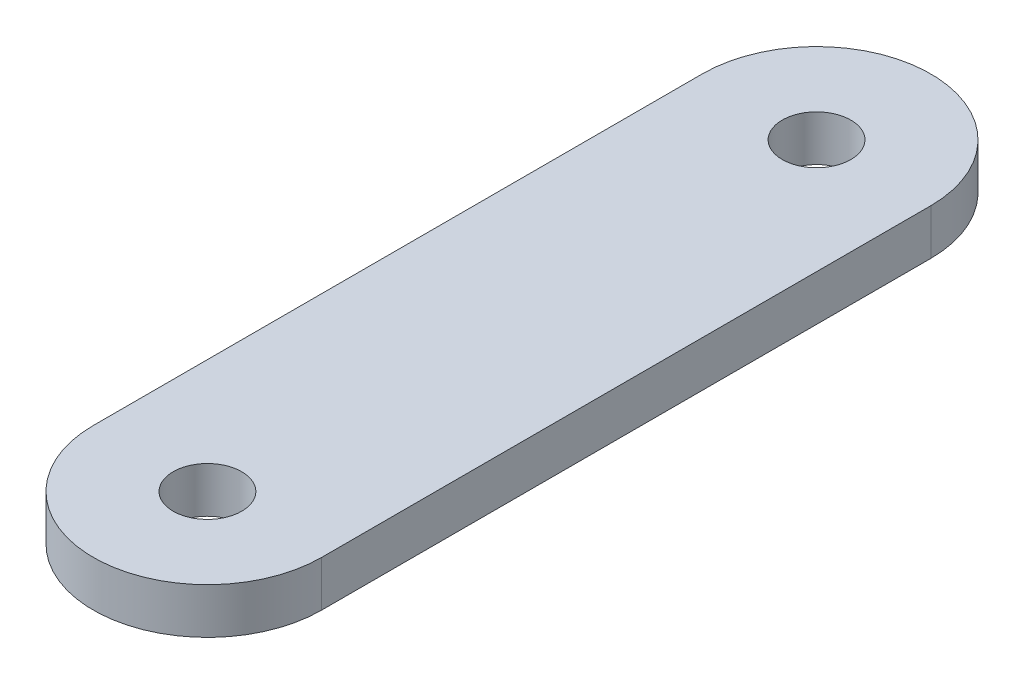
ISO-10303-21;
HEADER;
FILE_DESCRIPTION(('STEP AP214'),'2;1');
FILE_NAME('part.step','',(''),(''),'','','');
FILE_SCHEMA(('AUTOMOTIVE_DESIGN { 1 0 10303 214 1 1 1 1 }'));
ENDSEC;
DATA;
#1=APPLICATION_CONTEXT('core data for automotive mechanical design processes');
#2=APPLICATION_PROTOCOL_DEFINITION('international standard','automotive_design',2000,#1);
#3=PRODUCT_CONTEXT('',#1,'mechanical');
#4=PRODUCT('Part','Part','',(#3));
#5=PRODUCT_RELATED_PRODUCT_CATEGORY('part','',(#4));
#6=PRODUCT_DEFINITION_FORMATION('','',#4);
#7=PRODUCT_DEFINITION_CONTEXT('part definition',#1,'design');
#8=PRODUCT_DEFINITION('design','',#6,#7);
#9=PRODUCT_DEFINITION_SHAPE('','',#8);
#10=(LENGTH_UNIT() NAMED_UNIT(*) SI_UNIT(.MILLI.,.METRE.));
#11=(NAMED_UNIT(*) PLANE_ANGLE_UNIT() SI_UNIT($,.RADIAN.));
#12=(NAMED_UNIT(*) SI_UNIT($,.STERADIAN.) SOLID_ANGLE_UNIT());
#13=UNCERTAINTY_MEASURE_WITH_UNIT(LENGTH_MEASURE(1.E-05),#10,'distance_accuracy_value','');
#14=(GEOMETRIC_REPRESENTATION_CONTEXT(3) GLOBAL_UNCERTAINTY_ASSIGNED_CONTEXT((#13)) GLOBAL_UNIT_ASSIGNED_CONTEXT((#10,
#11,#12)) REPRESENTATION_CONTEXT('',''));
#15=CARTESIAN_POINT('',(0.,0.,0.));
#16=DIRECTION('',(0.,0.,1.));
#17=DIRECTION('',(1.,0.,0.));
#18=AXIS2_PLACEMENT_3D('',#15,#16,#17);
#19=CARTESIAN_POINT('',(0.,3.,-40.));
#20=DIRECTION('',(0.,1.,0.));
#21=DIRECTION('',(0.,0.,1.));
#22=AXIS2_PLACEMENT_3D('',#19,#20,#21);
#23=PLANE('',#22);
#24=CARTESIAN_POINT('',(0.,3.,0.));
#25=DIRECTION('',(0.,1.,0.));
#26=DIRECTION('',(0.,0.,1.));
#27=AXIS2_PLACEMENT_3D('',#24,#25,#26);
#28=CIRCLE('',#27,2.25);
#29=CARTESIAN_POINT('',(0.,3.,2.25));
#30=VERTEX_POINT('',#29);
#31=EDGE_CURVE('E100',#30,#30,#28,.T.);
#32=ORIENTED_EDGE('',*,*,#31,.F.);
#33=EDGE_LOOP('',(#32));
#34=FACE_BOUND('',#33,.T.);
#35=CARTESIAN_POINT('',(0.,3.,-40.));
#36=DIRECTION('',(0.,1.,0.));
#37=DIRECTION('',(0.,0.,1.));
#38=AXIS2_PLACEMENT_3D('',#35,#36,#37);
#39=CIRCLE('',#38,7.50000000000001);
#40=CARTESIAN_POINT('',(7.50000000000001,3.,-40.));
#41=VERTEX_POINT('',#40);
#42=CARTESIAN_POINT('',(-7.50000000000001,3.,-40.));
#43=VERTEX_POINT('',#42);
#44=EDGE_CURVE('E85',#41,#43,#39,.T.);
#45=ORIENTED_EDGE('',*,*,#44,.T.);
#46=DIRECTION('',(0.,0.,1.));
#47=VECTOR('',#46,1.);
#48=CARTESIAN_POINT('',(-7.50000000000001,3.,-40.));
#49=LINE('',#48,#47);
#50=CARTESIAN_POINT('',(-7.5,3.,0.));
#51=VERTEX_POINT('',#50);
#52=EDGE_CURVE('E80',#43,#51,#49,.T.);
#53=ORIENTED_EDGE('',*,*,#52,.T.);
#54=CARTESIAN_POINT('',(0.,3.,0.));
#55=DIRECTION('',(0.,1.,0.));
#56=DIRECTION('',(0.,0.,1.));
#57=AXIS2_PLACEMENT_3D('',#54,#55,#56);
#58=CIRCLE('',#57,7.5);
#59=CARTESIAN_POINT('',(7.5,3.,0.));
#60=VERTEX_POINT('',#59);
#61=EDGE_CURVE('E83',#51,#60,#58,.T.);
#62=ORIENTED_EDGE('',*,*,#61,.T.);
#63=DIRECTION('',(0.,0.,-1.));
#64=VECTOR('',#63,1.);
#65=CARTESIAN_POINT('',(7.50000000000001,3.,-40.));
#66=LINE('',#65,#64);
#67=EDGE_CURVE('E50',#60,#41,#66,.T.);
#68=ORIENTED_EDGE('',*,*,#67,.T.);
#69=EDGE_LOOP('',(#45,#53,#62,#68));
#70=FACE_BOUND('',#69,.T.);
#71=CARTESIAN_POINT('',(0.,3.,-40.));
#72=DIRECTION('',(0.,1.,0.));
#73=DIRECTION('',(0.,0.,1.));
#74=AXIS2_PLACEMENT_3D('',#71,#72,#73);
#75=CIRCLE('',#74,2.25);
#76=CARTESIAN_POINT('',(0.,3.,-37.75));
#77=VERTEX_POINT('',#76);
#78=EDGE_CURVE('E115',#77,#77,#75,.T.);
#79=ORIENTED_EDGE('',*,*,#78,.F.);
#80=EDGE_LOOP('',(#79));
#81=FACE_BOUND('',#80,.T.);
#82=ADVANCED_FACE('F33',(#34,#70,#81),#23,.T.);
#83=CARTESIAN_POINT('',(0.,0.,-40.));
#84=DIRECTION('',(0.,1.,0.));
#85=DIRECTION('',(0.,0.,1.));
#86=AXIS2_PLACEMENT_3D('',#83,#84,#85);
#87=PLANE('',#86);
#88=CARTESIAN_POINT('',(0.,0.,-40.));
#89=DIRECTION('',(0.,1.,0.));
#90=DIRECTION('',(0.,0.,1.));
#91=AXIS2_PLACEMENT_3D('',#88,#89,#90);
#92=CIRCLE('',#91,7.50000000000001);
#93=CARTESIAN_POINT('',(7.50000000000001,0.,-40.));
#94=VERTEX_POINT('',#93);
#95=CARTESIAN_POINT('',(-7.50000000000001,0.,-40.));
#96=VERTEX_POINT('',#95);
#97=EDGE_CURVE('E97',#94,#96,#92,.T.);
#98=ORIENTED_EDGE('',*,*,#97,.F.);
#99=DIRECTION('',(0.,0.,-1.));
#100=VECTOR('',#99,1.);
#101=CARTESIAN_POINT('',(7.50000000000001,0.,-40.));
#102=LINE('',#101,#100);
#103=CARTESIAN_POINT('',(7.5,0.,0.));
#104=VERTEX_POINT('',#103);
#105=EDGE_CURVE('E73',#104,#94,#102,.T.);
#106=ORIENTED_EDGE('',*,*,#105,.F.);
#107=CARTESIAN_POINT('',(0.,0.,0.));
#108=DIRECTION('',(0.,1.,0.));
#109=DIRECTION('',(0.,0.,1.));
#110=AXIS2_PLACEMENT_3D('',#107,#108,#109);
#111=CIRCLE('',#110,7.5);
#112=CARTESIAN_POINT('',(-7.5,0.,0.));
#113=VERTEX_POINT('',#112);
#114=EDGE_CURVE('E67',#113,#104,#111,.T.);
#115=ORIENTED_EDGE('',*,*,#114,.F.);
#116=DIRECTION('',(0.,0.,1.));
#117=VECTOR('',#116,1.);
#118=CARTESIAN_POINT('',(-7.50000000000001,0.,-40.));
#119=LINE('',#118,#117);
#120=EDGE_CURVE('E89',#96,#113,#119,.T.);
#121=ORIENTED_EDGE('',*,*,#120,.F.);
#122=EDGE_LOOP('',(#98,#106,#115,#121));
#123=FACE_BOUND('',#122,.T.);
#124=CARTESIAN_POINT('',(0.,0.,0.));
#125=DIRECTION('',(0.,1.,0.));
#126=DIRECTION('',(0.,0.,1.));
#127=AXIS2_PLACEMENT_3D('',#124,#125,#126);
#128=CIRCLE('',#127,2.25);
#129=CARTESIAN_POINT('',(0.,0.,2.25));
#130=VERTEX_POINT('',#129);
#131=EDGE_CURVE('E112',#130,#130,#128,.T.);
#132=ORIENTED_EDGE('',*,*,#131,.T.);
#133=EDGE_LOOP('',(#132));
#134=FACE_BOUND('',#133,.T.);
#135=CARTESIAN_POINT('',(0.,0.,-40.));
#136=DIRECTION('',(0.,1.,0.));
#137=DIRECTION('',(0.,0.,1.));
#138=AXIS2_PLACEMENT_3D('',#135,#136,#137);
#139=CIRCLE('',#138,2.25);
#140=CARTESIAN_POINT('',(0.,0.,-37.75));
#141=VERTEX_POINT('',#140);
#142=EDGE_CURVE('E118',#141,#141,#139,.T.);
#143=ORIENTED_EDGE('',*,*,#142,.T.);
#144=EDGE_LOOP('',(#143));
#145=FACE_BOUND('',#144,.T.);
#146=ADVANCED_FACE('F108',(#123,#134,#145),#87,.F.);
#147=CARTESIAN_POINT('',(0.,3.,-40.));
#148=DIRECTION('',(0.,-1.,0.));
#149=DIRECTION('',(0.,0.,-1.));
#150=AXIS2_PLACEMENT_3D('',#147,#148,#149);
#151=CYLINDRICAL_SURFACE('',#150,7.50000000000001);
#152=ORIENTED_EDGE('',*,*,#97,.T.);
#153=DIRECTION('',(0.,-1.,0.));
#154=VECTOR('',#153,1.);
#155=CARTESIAN_POINT('',(-7.50000000000001,3.,-40.));
#156=LINE('',#155,#154);
#157=EDGE_CURVE('E11',#43,#96,#156,.T.);
#158=ORIENTED_EDGE('',*,*,#157,.F.);
#159=ORIENTED_EDGE('',*,*,#44,.F.);
#160=DIRECTION('',(0.,-1.,0.));
#161=VECTOR('',#160,1.);
#162=CARTESIAN_POINT('',(7.50000000000001,3.,-40.));
#163=LINE('',#162,#161);
#164=EDGE_CURVE('E93',#41,#94,#163,.T.);
#165=ORIENTED_EDGE('',*,*,#164,.T.);
#166=EDGE_LOOP('',(#152,#158,#159,#165));
#167=FACE_BOUND('',#166,.T.);
#168=ADVANCED_FACE('F35',(#167),#151,.T.);
#169=CARTESIAN_POINT('',(-7.50000000000001,3.,-40.));
#170=DIRECTION('',(1.,0.,0.));
#171=DIRECTION('',(0.,0.,-1.));
#172=AXIS2_PLACEMENT_3D('',#169,#170,#171);
#173=PLANE('',#172);
#174=ORIENTED_EDGE('',*,*,#120,.T.);
#175=DIRECTION('',(0.,-1.,0.));
#176=VECTOR('',#175,1.);
#177=CARTESIAN_POINT('',(-7.5,3.,0.));
#178=LINE('',#177,#176);
#179=EDGE_CURVE('E42',#51,#113,#178,.T.);
#180=ORIENTED_EDGE('',*,*,#179,.F.);
#181=ORIENTED_EDGE('',*,*,#52,.F.);
#182=ORIENTED_EDGE('',*,*,#157,.T.);
#183=EDGE_LOOP('',(#174,#180,#181,#182));
#184=FACE_BOUND('',#183,.T.);
#185=ADVANCED_FACE('F88',(#184),#173,.F.);
#186=CARTESIAN_POINT('',(0.,3.,0.));
#187=DIRECTION('',(0.,-1.,0.));
#188=DIRECTION('',(0.,0.,-1.));
#189=AXIS2_PLACEMENT_3D('',#186,#187,#188);
#190=CYLINDRICAL_SURFACE('',#189,7.5);
#191=ORIENTED_EDGE('',*,*,#114,.T.);
#192=DIRECTION('',(0.,-1.,0.));
#193=VECTOR('',#192,1.);
#194=CARTESIAN_POINT('',(7.5,3.,0.));
#195=LINE('',#194,#193);
#196=EDGE_CURVE('E90',#60,#104,#195,.T.);
#197=ORIENTED_EDGE('',*,*,#196,.F.);
#198=ORIENTED_EDGE('',*,*,#61,.F.);
#199=ORIENTED_EDGE('',*,*,#179,.T.);
#200=EDGE_LOOP('',(#191,#197,#198,#199));
#201=FACE_BOUND('',#200,.T.);
#202=ADVANCED_FACE('F91',(#201),#190,.T.);
#203=CARTESIAN_POINT('',(7.50000000000001,3.,-40.));
#204=DIRECTION('',(-1.,0.,0.));
#205=DIRECTION('',(0.,0.,1.));
#206=AXIS2_PLACEMENT_3D('',#203,#204,#205);
#207=PLANE('',#206);
#208=ORIENTED_EDGE('',*,*,#105,.T.);
#209=ORIENTED_EDGE('',*,*,#164,.F.);
#210=ORIENTED_EDGE('',*,*,#67,.F.);
#211=ORIENTED_EDGE('',*,*,#196,.T.);
#212=EDGE_LOOP('',(#208,#209,#210,#211));
#213=FACE_BOUND('',#212,.T.);
#214=ADVANCED_FACE('F105',(#213),#207,.F.);
#215=CARTESIAN_POINT('',(0.,3.,0.));
#216=DIRECTION('',(0.,-1.,0.));
#217=DIRECTION('',(0.,0.,-1.));
#218=AXIS2_PLACEMENT_3D('',#215,#216,#217);
#219=CYLINDRICAL_SURFACE('',#218,2.25);
#220=ORIENTED_EDGE('',*,*,#31,.T.);
#221=EDGE_LOOP('',(#220));
#222=FACE_BOUND('',#221,.T.);
#223=ORIENTED_EDGE('',*,*,#131,.F.);
#224=EDGE_LOOP('',(#223));
#225=FACE_BOUND('',#224,.T.);
#226=ADVANCED_FACE('F135',(#222,#225),#219,.F.);
#227=CARTESIAN_POINT('',(0.,3.,-40.));
#228=DIRECTION('',(0.,-1.,0.));
#229=DIRECTION('',(0.,0.,-1.));
#230=AXIS2_PLACEMENT_3D('',#227,#228,#229);
#231=CYLINDRICAL_SURFACE('',#230,2.25);
#232=ORIENTED_EDGE('',*,*,#78,.T.);
#233=EDGE_LOOP('',(#232));
#234=FACE_BOUND('',#233,.T.);
#235=ORIENTED_EDGE('',*,*,#142,.F.);
#236=EDGE_LOOP('',(#235));
#237=FACE_BOUND('',#236,.T.);
#238=ADVANCED_FACE('F124',(#234,#237),#231,.F.);
#239=CLOSED_SHELL('',(#82,#146,#168,#185,#202,#214,#226,#238));
#240=MANIFOLD_SOLID_BREP('B2',#239);
#241=ADVANCED_BREP_SHAPE_REPRESENTATION('',(#18,#240),#14);
#242=SHAPE_DEFINITION_REPRESENTATION(#9,#241);
ENDSEC;
END-ISO-10303-21;
